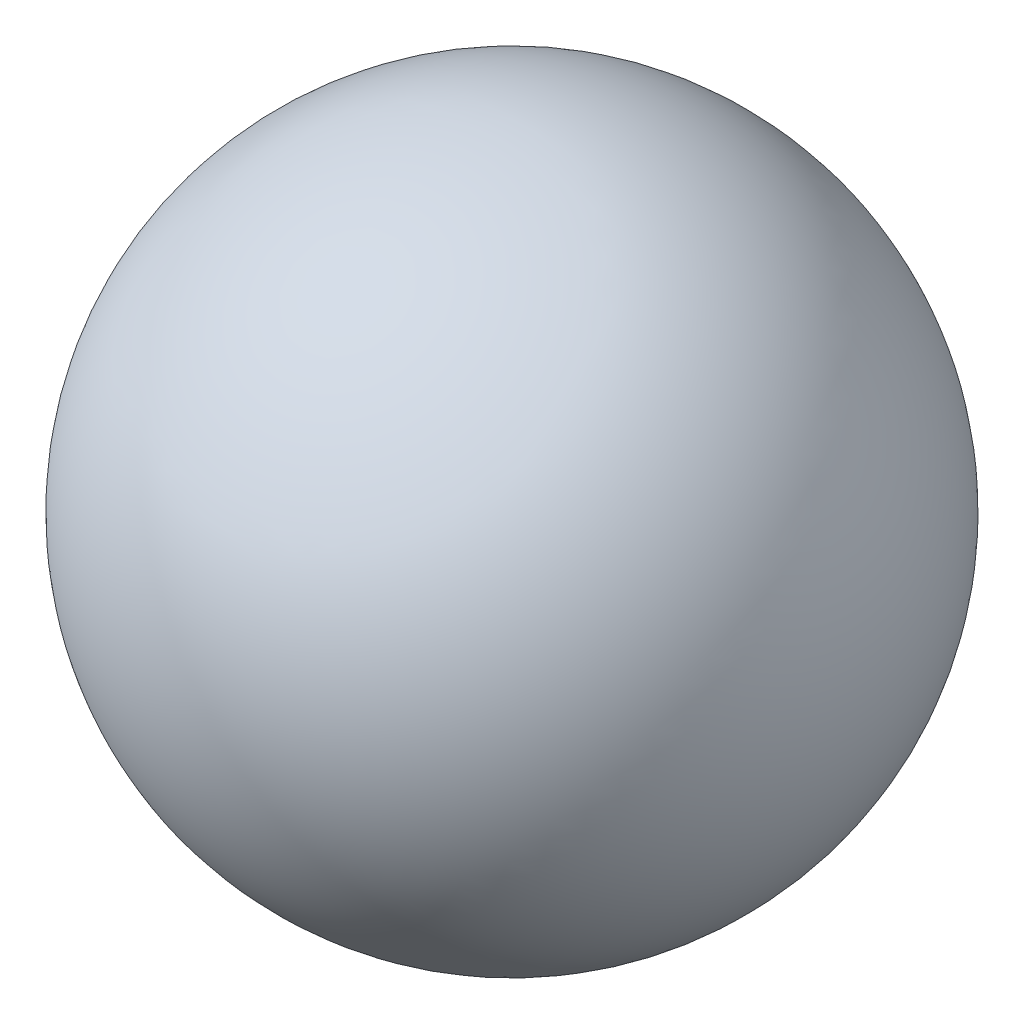
ISO-10303-21;
HEADER;
FILE_DESCRIPTION(('STEP AP214'),'2;1');
FILE_NAME('part.step','',(''),(''),'','','');
FILE_SCHEMA(('AUTOMOTIVE_DESIGN { 1 0 10303 214 1 1 1 1 }'));
ENDSEC;
DATA;
#1=APPLICATION_CONTEXT('core data for automotive mechanical design processes');
#2=APPLICATION_PROTOCOL_DEFINITION('international standard','automotive_design',2000,#1);
#3=PRODUCT_CONTEXT('',#1,'mechanical');
#4=PRODUCT('Part','Part','',(#3));
#5=PRODUCT_RELATED_PRODUCT_CATEGORY('part','',(#4));
#6=PRODUCT_DEFINITION_FORMATION('','',#4);
#7=PRODUCT_DEFINITION_CONTEXT('part definition',#1,'design');
#8=PRODUCT_DEFINITION('design','',#6,#7);
#9=PRODUCT_DEFINITION_SHAPE('','',#8);
#10=(LENGTH_UNIT() NAMED_UNIT(*) SI_UNIT(.MILLI.,.METRE.));
#11=(NAMED_UNIT(*) PLANE_ANGLE_UNIT() SI_UNIT($,.RADIAN.));
#12=(NAMED_UNIT(*) SI_UNIT($,.STERADIAN.) SOLID_ANGLE_UNIT());
#13=UNCERTAINTY_MEASURE_WITH_UNIT(LENGTH_MEASURE(1.E-05),#10,'distance_accuracy_value','');
#14=(GEOMETRIC_REPRESENTATION_CONTEXT(3) GLOBAL_UNCERTAINTY_ASSIGNED_CONTEXT((#13)) GLOBAL_UNIT_ASSIGNED_CONTEXT((#10,
#11,#12)) REPRESENTATION_CONTEXT('',''));
#15=CARTESIAN_POINT('',(0.,0.,0.));
#16=DIRECTION('',(0.,0.,1.));
#17=DIRECTION('',(1.,0.,0.));
#18=AXIS2_PLACEMENT_3D('',#15,#16,#17);
#19=CARTESIAN_POINT('',(0.,0.,0.));
#20=DIRECTION('',(0.,0.,-1.));
#21=DIRECTION('',(1.,0.,0.));
#22=AXIS2_PLACEMENT_3D('',#19,#20,#21);
#23=SPHERICAL_SURFACE('',#22,6.);
#24=CARTESIAN_POINT('',(0.,0.,-6.));
#25=VERTEX_POINT('',#24);
#26=VERTEX_LOOP('',#25);
#27=FACE_BOUND('',#26,.T.);
#28=ADVANCED_FACE('F30',(#27),#23,.T.);
#29=CLOSED_SHELL('',(#28));
#30=MANIFOLD_SOLID_BREP('B2',#29);
#31=ADVANCED_BREP_SHAPE_REPRESENTATION('',(#18,#30),#14);
#32=SHAPE_DEFINITION_REPRESENTATION(#9,#31);
ENDSEC;
END-ISO-10303-21;
